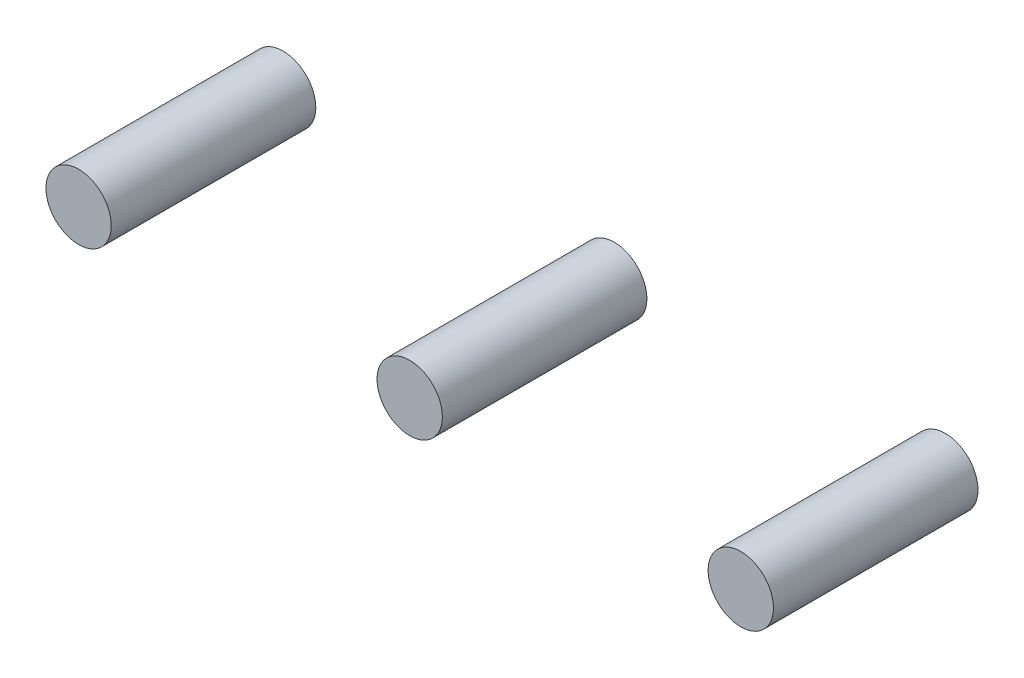
ISO-10303-21;
HEADER;
FILE_DESCRIPTION(('STEP AP214'),'2;1');
FILE_NAME('part.step','',(''),(''),'','','');
FILE_SCHEMA(('AUTOMOTIVE_DESIGN { 1 0 10303 214 1 1 1 1 }'));
ENDSEC;
DATA;
#1=APPLICATION_CONTEXT('core data for automotive mechanical design processes');
#2=APPLICATION_PROTOCOL_DEFINITION('international standard','automotive_design',2000,#1);
#3=PRODUCT_CONTEXT('',#1,'mechanical');
#4=PRODUCT('Part','Part','',(#3));
#5=PRODUCT_RELATED_PRODUCT_CATEGORY('part','',(#4));
#6=PRODUCT_DEFINITION_FORMATION('','',#4);
#7=PRODUCT_DEFINITION_CONTEXT('part definition',#1,'design');
#8=PRODUCT_DEFINITION('design','',#6,#7);
#9=PRODUCT_DEFINITION_SHAPE('','',#8);
#10=(LENGTH_UNIT() NAMED_UNIT(*) SI_UNIT(.MILLI.,.METRE.));
#11=(NAMED_UNIT(*) PLANE_ANGLE_UNIT() SI_UNIT($,.RADIAN.));
#12=(NAMED_UNIT(*) SI_UNIT($,.STERADIAN.) SOLID_ANGLE_UNIT());
#13=UNCERTAINTY_MEASURE_WITH_UNIT(LENGTH_MEASURE(1.E-05),#10,'distance_accuracy_value','');
#14=(GEOMETRIC_REPRESENTATION_CONTEXT(3) GLOBAL_UNCERTAINTY_ASSIGNED_CONTEXT((#13)) GLOBAL_UNIT_ASSIGNED_CONTEXT((#10,
#11,#12)) REPRESENTATION_CONTEXT('',''));
#15=CARTESIAN_POINT('',(0.,0.,0.));
#16=DIRECTION('',(0.,0.,1.));
#17=DIRECTION('',(1.,0.,0.));
#18=AXIS2_PLACEMENT_3D('',#15,#16,#17);
#19=CARTESIAN_POINT('',(0.,0.,-5.));
#20=DIRECTION('',(0.,0.,1.));
#21=DIRECTION('',(1.,0.,0.));
#22=AXIS2_PLACEMENT_3D('',#19,#20,#21);
#23=PLANE('',#22);
#24=CARTESIAN_POINT('',(0.,0.,-5.));
#25=DIRECTION('',(0.,0.,1.));
#26=DIRECTION('',(1.,0.,0.));
#27=AXIS2_PLACEMENT_3D('',#24,#25,#26);
#28=CIRCLE('',#27,0.8144);
#29=CARTESIAN_POINT('',(0.8144,0.,-5.));
#30=VERTEX_POINT('',#29);
#31=EDGE_CURVE('P0_E11',#30,#30,#28,.T.);
#32=ORIENTED_EDGE('',*,*,#31,.F.);
#33=EDGE_LOOP('',(#32));
#34=FACE_BOUND('',#33,.T.);
#35=ADVANCED_FACE('P0_F16',(#34),#23,.F.);
#36=CARTESIAN_POINT('',(0.,0.,0.1));
#37=DIRECTION('',(0.,0.,1.));
#38=DIRECTION('',(1.,0.,0.));
#39=AXIS2_PLACEMENT_3D('',#36,#37,#38);
#40=PLANE('',#39);
#41=CARTESIAN_POINT('',(0.,0.,0.1));
#42=DIRECTION('',(0.,0.,1.));
#43=DIRECTION('',(1.,0.,0.));
#44=AXIS2_PLACEMENT_3D('',#41,#42,#43);
#45=CIRCLE('',#44,0.8144);
#46=CARTESIAN_POINT('',(0.8144,0.,0.1));
#47=VERTEX_POINT('',#46);
#48=EDGE_CURVE('P0_E41',#47,#47,#45,.T.);
#49=ORIENTED_EDGE('',*,*,#48,.T.);
#50=EDGE_LOOP('',(#49));
#51=FACE_BOUND('',#50,.T.);
#52=ADVANCED_FACE('P0_F18',(#51),#40,.T.);
#53=CARTESIAN_POINT('',(0.,0.,-5.));
#54=DIRECTION('',(0.,0.,1.));
#55=DIRECTION('',(1.,0.,0.));
#56=AXIS2_PLACEMENT_3D('',#53,#54,#55);
#57=CYLINDRICAL_SURFACE('',#56,0.8144);
#58=ORIENTED_EDGE('',*,*,#48,.F.);
#59=DIRECTION('',(0.,0.,1.));
#60=VECTOR('',#59,1.);
#61=CARTESIAN_POINT('',(0.8144,0.,-5.));
#62=LINE('',#61,#60);
#63=EDGE_CURVE('P0_E25',#30,#47,#62,.T.);
#64=ORIENTED_EDGE('',*,*,#63,.F.);
#65=ORIENTED_EDGE('',*,*,#31,.T.);
#66=ORIENTED_EDGE('',*,*,#63,.T.);
#67=EDGE_LOOP('',(#58,#64,#65,#66));
#68=FACE_BOUND('',#67,.T.);
#69=ADVANCED_FACE('P0_F40',(#68),#57,.T.);
#70=CLOSED_SHELL('',(#35,#52,#69));
#71=MANIFOLD_SOLID_BREP('P0_B1',#70);
#72=CARTESIAN_POINT('',(8.255,0.,-5.));
#73=DIRECTION('',(0.,0.,1.));
#74=DIRECTION('',(1.,0.,0.));
#75=AXIS2_PLACEMENT_3D('',#72,#73,#74);
#76=PLANE('',#75);
#77=CARTESIAN_POINT('',(8.255,0.,-5.));
#78=DIRECTION('',(0.,0.,1.));
#79=DIRECTION('',(1.,0.,0.));
#80=AXIS2_PLACEMENT_3D('',#77,#78,#79);
#81=CIRCLE('',#80,0.8144);
#82=CARTESIAN_POINT('',(9.0694,0.,-5.));
#83=VERTEX_POINT('',#82);
#84=EDGE_CURVE('P1_E11',#83,#83,#81,.T.);
#85=ORIENTED_EDGE('',*,*,#84,.F.);
#86=EDGE_LOOP('',(#85));
#87=FACE_BOUND('',#86,.T.);
#88=ADVANCED_FACE('P1_F16',(#87),#76,.F.);
#89=CARTESIAN_POINT('',(8.255,0.,0.1));
#90=DIRECTION('',(0.,0.,1.));
#91=DIRECTION('',(1.,0.,0.));
#92=AXIS2_PLACEMENT_3D('',#89,#90,#91);
#93=PLANE('',#92);
#94=CARTESIAN_POINT('',(8.255,0.,0.1));
#95=DIRECTION('',(0.,0.,1.));
#96=DIRECTION('',(1.,0.,0.));
#97=AXIS2_PLACEMENT_3D('',#94,#95,#96);
#98=CIRCLE('',#97,0.8144);
#99=CARTESIAN_POINT('',(9.0694,0.,0.1));
#100=VERTEX_POINT('',#99);
#101=EDGE_CURVE('P1_E40',#100,#100,#98,.T.);
#102=ORIENTED_EDGE('',*,*,#101,.T.);
#103=EDGE_LOOP('',(#102));
#104=FACE_BOUND('',#103,.T.);
#105=ADVANCED_FACE('P1_F43',(#104),#93,.T.);
#106=CARTESIAN_POINT('',(8.255,0.,-5.));
#107=DIRECTION('',(0.,0.,1.));
#108=DIRECTION('',(1.,0.,0.));
#109=AXIS2_PLACEMENT_3D('',#106,#107,#108);
#110=CYLINDRICAL_SURFACE('',#109,0.8144);
#111=ORIENTED_EDGE('',*,*,#101,.F.);
#112=DIRECTION('',(0.,0.,1.));
#113=VECTOR('',#112,1.);
#114=CARTESIAN_POINT('',(9.0694,0.,-5.));
#115=LINE('',#114,#113);
#116=EDGE_CURVE('P1_E26',#83,#100,#115,.T.);
#117=ORIENTED_EDGE('',*,*,#116,.F.);
#118=ORIENTED_EDGE('',*,*,#84,.T.);
#119=ORIENTED_EDGE('',*,*,#116,.T.);
#120=EDGE_LOOP('',(#111,#117,#118,#119));
#121=FACE_BOUND('',#120,.T.);
#122=ADVANCED_FACE('P1_F18',(#121),#110,.T.);
#123=CLOSED_SHELL('',(#88,#105,#122));
#124=MANIFOLD_SOLID_BREP('P1_B1',#123);
#125=CARTESIAN_POINT('',(16.51,0.,-5.));
#126=DIRECTION('',(0.,0.,1.));
#127=DIRECTION('',(1.,0.,0.));
#128=AXIS2_PLACEMENT_3D('',#125,#126,#127);
#129=PLANE('',#128);
#130=CARTESIAN_POINT('',(16.51,0.,-5.));
#131=DIRECTION('',(0.,0.,1.));
#132=DIRECTION('',(1.,0.,0.));
#133=AXIS2_PLACEMENT_3D('',#130,#131,#132);
#134=CIRCLE('',#133,0.8144);
#135=CARTESIAN_POINT('',(17.3244,0.,-5.));
#136=VERTEX_POINT('',#135);
#137=EDGE_CURVE('P2_E11',#136,#136,#134,.T.);
#138=ORIENTED_EDGE('',*,*,#137,.F.);
#139=EDGE_LOOP('',(#138));
#140=FACE_BOUND('',#139,.T.);
#141=ADVANCED_FACE('P2_F16',(#140),#129,.F.);
#142=CARTESIAN_POINT('',(16.51,0.,0.1));
#143=DIRECTION('',(0.,0.,1.));
#144=DIRECTION('',(1.,0.,0.));
#145=AXIS2_PLACEMENT_3D('',#142,#143,#144);
#146=PLANE('',#145);
#147=CARTESIAN_POINT('',(16.51,0.,0.1));
#148=DIRECTION('',(0.,0.,1.));
#149=DIRECTION('',(1.,0.,0.));
#150=AXIS2_PLACEMENT_3D('',#147,#148,#149);
#151=CIRCLE('',#150,0.8144);
#152=CARTESIAN_POINT('',(17.3244,0.,0.1));
#153=VERTEX_POINT('',#152);
#154=EDGE_CURVE('P2_E40',#153,#153,#151,.T.);
#155=ORIENTED_EDGE('',*,*,#154,.T.);
#156=EDGE_LOOP('',(#155));
#157=FACE_BOUND('',#156,.T.);
#158=ADVANCED_FACE('P2_F44',(#157),#146,.T.);
#159=CARTESIAN_POINT('',(16.51,0.,-5.));
#160=DIRECTION('',(0.,0.,1.));
#161=DIRECTION('',(1.,0.,0.));
#162=AXIS2_PLACEMENT_3D('',#159,#160,#161);
#163=CYLINDRICAL_SURFACE('',#162,0.8144);
#164=ORIENTED_EDGE('',*,*,#154,.F.);
#165=DIRECTION('',(0.,0.,1.));
#166=VECTOR('',#165,1.);
#167=CARTESIAN_POINT('',(17.3244,0.,-5.));
#168=LINE('',#167,#166);
#169=EDGE_CURVE('P2_E24',#136,#153,#168,.T.);
#170=ORIENTED_EDGE('',*,*,#169,.F.);
#171=ORIENTED_EDGE('',*,*,#137,.T.);
#172=ORIENTED_EDGE('',*,*,#169,.T.);
#173=EDGE_LOOP('',(#164,#170,#171,#172));
#174=FACE_BOUND('',#173,.T.);
#175=ADVANCED_FACE('P2_F39',(#174),#163,.T.);
#176=CLOSED_SHELL('',(#141,#158,#175));
#177=MANIFOLD_SOLID_BREP('P2_B1',#176);
#178=ADVANCED_BREP_SHAPE_REPRESENTATION('',(#18,#71,#124,#177),#14);
#179=SHAPE_DEFINITION_REPRESENTATION(#9,#178);
ENDSEC;
END-ISO-10303-21;
